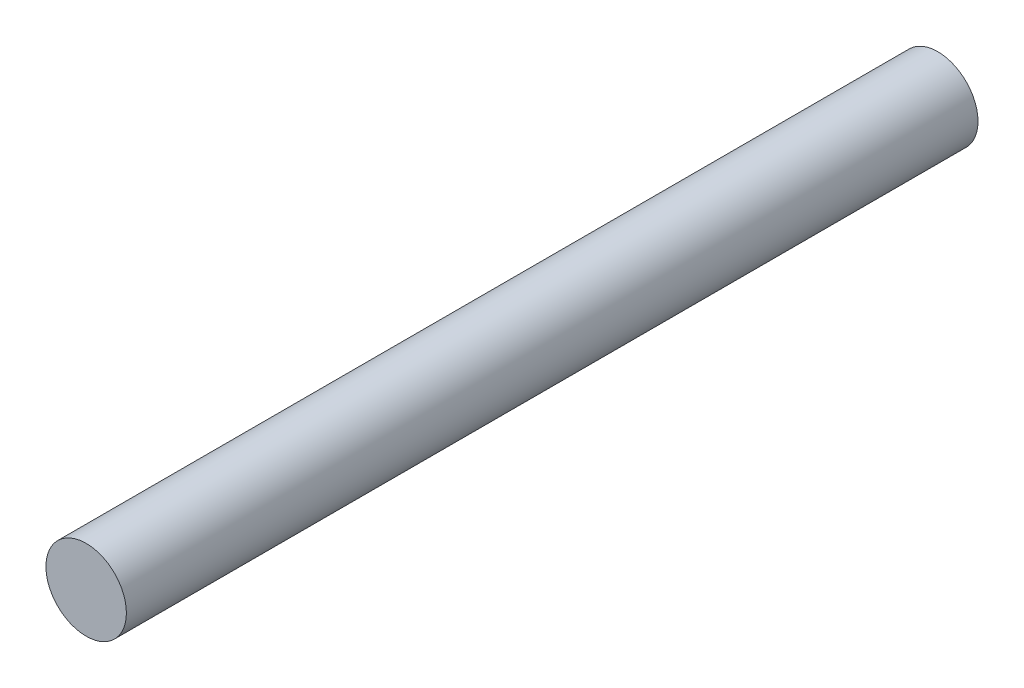
ISO-10303-21;
HEADER;
FILE_DESCRIPTION(('STEP AP214'),'2;1');
FILE_NAME('part.step','',(''),(''),'','','');
FILE_SCHEMA(('AUTOMOTIVE_DESIGN { 1 0 10303 214 1 1 1 1 }'));
ENDSEC;
DATA;
#1=APPLICATION_CONTEXT('core data for automotive mechanical design processes');
#2=APPLICATION_PROTOCOL_DEFINITION('international standard','automotive_design',2000,#1);
#3=PRODUCT_CONTEXT('',#1,'mechanical');
#4=PRODUCT('Part','Part','',(#3));
#5=PRODUCT_RELATED_PRODUCT_CATEGORY('part','',(#4));
#6=PRODUCT_DEFINITION_FORMATION('','',#4);
#7=PRODUCT_DEFINITION_CONTEXT('part definition',#1,'design');
#8=PRODUCT_DEFINITION('design','',#6,#7);
#9=PRODUCT_DEFINITION_SHAPE('','',#8);
#10=(LENGTH_UNIT() NAMED_UNIT(*) SI_UNIT(.MILLI.,.METRE.));
#11=(NAMED_UNIT(*) PLANE_ANGLE_UNIT() SI_UNIT($,.RADIAN.));
#12=(NAMED_UNIT(*) SI_UNIT($,.STERADIAN.) SOLID_ANGLE_UNIT());
#13=UNCERTAINTY_MEASURE_WITH_UNIT(LENGTH_MEASURE(1.E-05),#10,'distance_accuracy_value','');
#14=(GEOMETRIC_REPRESENTATION_CONTEXT(3) GLOBAL_UNCERTAINTY_ASSIGNED_CONTEXT((#13)) GLOBAL_UNIT_ASSIGNED_CONTEXT((#10,
#11,#12)) REPRESENTATION_CONTEXT('',''));
#15=CARTESIAN_POINT('',(0.,0.,0.));
#16=DIRECTION('',(0.,0.,1.));
#17=DIRECTION('',(1.,0.,0.));
#18=AXIS2_PLACEMENT_3D('',#15,#16,#17);
#19=CARTESIAN_POINT('',(0.,0.,63.5));
#20=DIRECTION('',(0.,0.,-1.));
#21=DIRECTION('',(-1.,0.,0.));
#22=AXIS2_PLACEMENT_3D('',#19,#20,#21);
#23=CYLINDRICAL_SURFACE('',#22,3.);
#24=CARTESIAN_POINT('',(0.,0.,63.5));
#25=DIRECTION('',(0.,0.,1.));
#26=DIRECTION('',(1.,0.,0.));
#27=AXIS2_PLACEMENT_3D('',#24,#25,#26);
#28=CIRCLE('',#27,3.);
#29=CARTESIAN_POINT('',(3.,0.,63.5));
#30=VERTEX_POINT('',#29);
#31=EDGE_CURVE('E10',#30,#30,#28,.T.);
#32=ORIENTED_EDGE('',*,*,#31,.F.);
#33=EDGE_LOOP('',(#32));
#34=FACE_BOUND('',#33,.T.);
#35=CARTESIAN_POINT('',(0.,0.,0.));
#36=DIRECTION('',(0.,0.,1.));
#37=DIRECTION('',(1.,0.,0.));
#38=AXIS2_PLACEMENT_3D('',#35,#36,#37);
#39=CIRCLE('',#38,3.);
#40=CARTESIAN_POINT('',(3.,0.,0.));
#41=VERTEX_POINT('',#40);
#42=EDGE_CURVE('E37',#41,#41,#39,.T.);
#43=ORIENTED_EDGE('',*,*,#42,.T.);
#44=EDGE_LOOP('',(#43));
#45=FACE_BOUND('',#44,.T.);
#46=ADVANCED_FACE('F34',(#34,#45),#23,.T.);
#47=CARTESIAN_POINT('',(0.,0.,63.5));
#48=DIRECTION('',(0.,0.,1.));
#49=DIRECTION('',(1.,0.,0.));
#50=AXIS2_PLACEMENT_3D('',#47,#48,#49);
#51=PLANE('',#50);
#52=ORIENTED_EDGE('',*,*,#31,.T.);
#53=EDGE_LOOP('',(#52));
#54=FACE_BOUND('',#53,.T.);
#55=ADVANCED_FACE('F51',(#54),#51,.T.);
#56=CARTESIAN_POINT('',(0.,0.,0.));
#57=DIRECTION('',(0.,0.,1.));
#58=DIRECTION('',(1.,0.,0.));
#59=AXIS2_PLACEMENT_3D('',#56,#57,#58);
#60=PLANE('',#59);
#61=ORIENTED_EDGE('',*,*,#42,.F.);
#62=EDGE_LOOP('',(#61));
#63=FACE_BOUND('',#62,.T.);
#64=ADVANCED_FACE('F49',(#63),#60,.F.);
#65=CLOSED_SHELL('',(#46,#55,#64));
#66=MANIFOLD_SOLID_BREP('B2',#65);
#67=ADVANCED_BREP_SHAPE_REPRESENTATION('',(#18,#66),#14);
#68=SHAPE_DEFINITION_REPRESENTATION(#9,#67);
ENDSEC;
END-ISO-10303-21;
